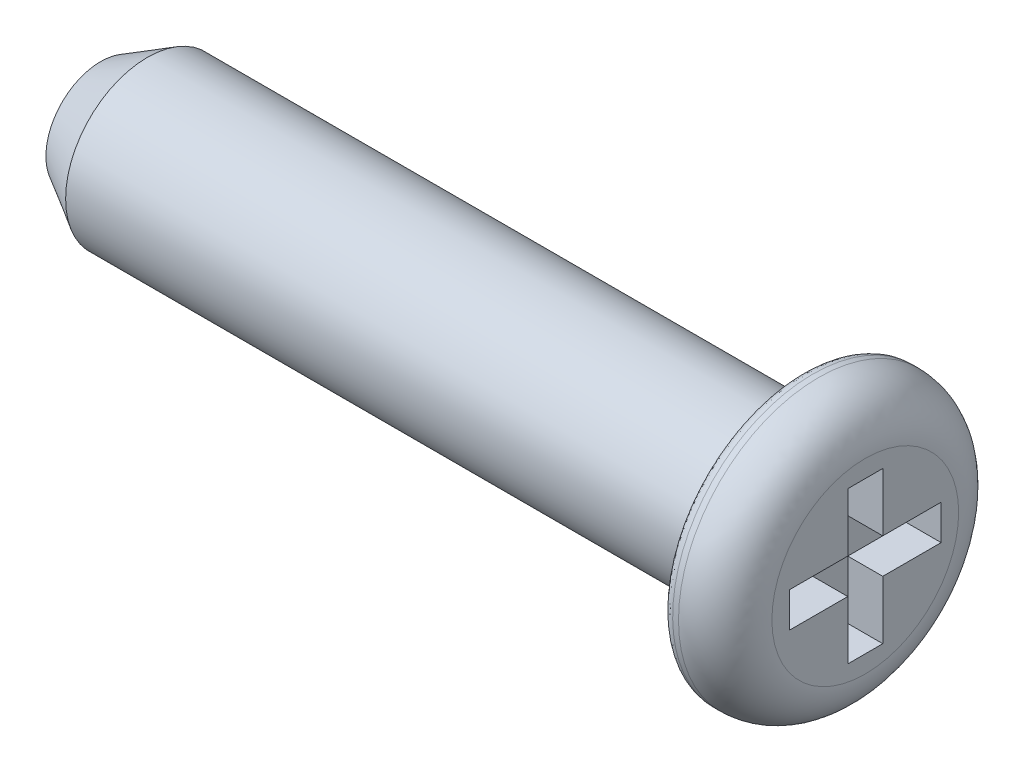
ISO-10303-21;
HEADER;
FILE_DESCRIPTION(('STEP AP214'),'2;1');
FILE_NAME('part.step','',(''),(''),'','','');
FILE_SCHEMA(('AUTOMOTIVE_DESIGN { 1 0 10303 214 1 1 1 1 }'));
ENDSEC;
DATA;
#1=APPLICATION_CONTEXT('core data for automotive mechanical design processes');
#2=APPLICATION_PROTOCOL_DEFINITION('international standard','automotive_design',2000,#1);
#3=PRODUCT_CONTEXT('',#1,'mechanical');
#4=PRODUCT('Part','Part','',(#3));
#5=PRODUCT_RELATED_PRODUCT_CATEGORY('part','',(#4));
#6=PRODUCT_DEFINITION_FORMATION('','',#4);
#7=PRODUCT_DEFINITION_CONTEXT('part definition',#1,'design');
#8=PRODUCT_DEFINITION('design','',#6,#7);
#9=PRODUCT_DEFINITION_SHAPE('','',#8);
#10=(LENGTH_UNIT() NAMED_UNIT(*) SI_UNIT(.MILLI.,.METRE.));
#11=(NAMED_UNIT(*) PLANE_ANGLE_UNIT() SI_UNIT($,.RADIAN.));
#12=(NAMED_UNIT(*) SI_UNIT($,.STERADIAN.) SOLID_ANGLE_UNIT());
#13=UNCERTAINTY_MEASURE_WITH_UNIT(LENGTH_MEASURE(1.E-05),#10,'distance_accuracy_value','');
#14=(GEOMETRIC_REPRESENTATION_CONTEXT(3) GLOBAL_UNCERTAINTY_ASSIGNED_CONTEXT((#13)) GLOBAL_UNIT_ASSIGNED_CONTEXT((#10,
#11,#12)) REPRESENTATION_CONTEXT('',''));
#15=CARTESIAN_POINT('',(0.,0.,0.));
#16=DIRECTION('',(0.,0.,1.));
#17=DIRECTION('',(1.,0.,0.));
#18=AXIS2_PLACEMENT_3D('',#15,#16,#17);
#19=CARTESIAN_POINT('',(6.75,3.124,9.876));
#20=DIRECTION('',(1.,0.,0.));
#21=DIRECTION('',(0.,0.,-1.));
#22=AXIS2_PLACEMENT_3D('',#19,#20,#21);
#23=PLANE('',#22);
#24=DIRECTION('',(0.,-1.,0.));
#25=VECTOR('',#24,1.);
#26=CARTESIAN_POINT('',(6.75,3.8,9.85));
#27=LINE('',#26,#25);
#28=CARTESIAN_POINT('',(6.75,3.95,9.85));
#29=VERTEX_POINT('',#28);
#30=CARTESIAN_POINT('',(6.75,3.65,9.85));
#31=VERTEX_POINT('',#30);
#32=EDGE_CURVE('E184',#29,#31,#27,.T.);
#33=ORIENTED_EDGE('',*,*,#32,.T.);
#34=DIRECTION('',(0.,0.,-1.));
#35=VECTOR('',#34,1.);
#36=CARTESIAN_POINT('',(6.75,3.65,9.6));
#37=LINE('',#36,#35);
#38=CARTESIAN_POINT('',(6.75,3.65,9.35));
#39=VERTEX_POINT('',#38);
#40=EDGE_CURVE('E376',#31,#39,#37,.T.);
#41=ORIENTED_EDGE('',*,*,#40,.T.);
#42=DIRECTION('',(0.,-1.,0.));
#43=VECTOR('',#42,1.);
#44=CARTESIAN_POINT('',(6.75,3.4,9.35));
#45=LINE('',#44,#43);
#46=CARTESIAN_POINT('',(6.75,3.15,9.35));
#47=VERTEX_POINT('',#46);
#48=EDGE_CURVE('E370',#39,#47,#45,.T.);
#49=ORIENTED_EDGE('',*,*,#48,.T.);
#50=DIRECTION('',(0.,0.,-1.));
#51=VECTOR('',#50,1.);
#52=CARTESIAN_POINT('',(6.75,3.15,9.2));
#53=LINE('',#52,#51);
#54=CARTESIAN_POINT('',(6.75,3.15,9.05));
#55=VERTEX_POINT('',#54);
#56=EDGE_CURVE('E363',#47,#55,#53,.T.);
#57=ORIENTED_EDGE('',*,*,#56,.T.);
#58=DIRECTION('',(0.,1.,0.));
#59=VECTOR('',#58,1.);
#60=CARTESIAN_POINT('',(6.75,3.4,9.05));
#61=LINE('',#60,#59);
#62=CARTESIAN_POINT('',(6.75,3.65,9.05));
#63=VERTEX_POINT('',#62);
#64=EDGE_CURVE('E356',#55,#63,#61,.T.);
#65=ORIENTED_EDGE('',*,*,#64,.T.);
#66=DIRECTION('',(0.,0.,-1.));
#67=VECTOR('',#66,1.);
#68=CARTESIAN_POINT('',(6.75,3.65,8.8));
#69=LINE('',#68,#67);
#70=CARTESIAN_POINT('',(6.75,3.65,8.55));
#71=VERTEX_POINT('',#70);
#72=EDGE_CURVE('E349',#63,#71,#69,.T.);
#73=ORIENTED_EDGE('',*,*,#72,.T.);
#74=DIRECTION('',(0.,1.,0.));
#75=VECTOR('',#74,1.);
#76=CARTESIAN_POINT('',(6.75,3.8,8.55));
#77=LINE('',#76,#75);
#78=CARTESIAN_POINT('',(6.75,3.95,8.55));
#79=VERTEX_POINT('',#78);
#80=EDGE_CURVE('E342',#71,#79,#77,.T.);
#81=ORIENTED_EDGE('',*,*,#80,.T.);
#82=DIRECTION('',(0.,0.,1.));
#83=VECTOR('',#82,1.);
#84=CARTESIAN_POINT('',(6.75,3.95,8.8));
#85=LINE('',#84,#83);
#86=CARTESIAN_POINT('',(6.75,3.95,9.05));
#87=VERTEX_POINT('',#86);
#88=EDGE_CURVE('E335',#79,#87,#85,.T.);
#89=ORIENTED_EDGE('',*,*,#88,.T.);
#90=DIRECTION('',(0.,1.,0.));
#91=VECTOR('',#90,1.);
#92=CARTESIAN_POINT('',(6.75,4.2,9.05));
#93=LINE('',#92,#91);
#94=CARTESIAN_POINT('',(6.75,4.45,9.05));
#95=VERTEX_POINT('',#94);
#96=EDGE_CURVE('E328',#87,#95,#93,.T.);
#97=ORIENTED_EDGE('',*,*,#96,.T.);
#98=DIRECTION('',(0.,0.,1.));
#99=VECTOR('',#98,1.);
#100=CARTESIAN_POINT('',(6.75,4.45,9.2));
#101=LINE('',#100,#99);
#102=CARTESIAN_POINT('',(6.75,4.45,9.35));
#103=VERTEX_POINT('',#102);
#104=EDGE_CURVE('E161',#95,#103,#101,.T.);
#105=ORIENTED_EDGE('',*,*,#104,.T.);
#106=DIRECTION('',(0.,-1.,0.));
#107=VECTOR('',#106,1.);
#108=CARTESIAN_POINT('',(6.75,4.2,9.35));
#109=LINE('',#108,#107);
#110=CARTESIAN_POINT('',(6.75,3.95,9.35));
#111=VERTEX_POINT('',#110);
#112=EDGE_CURVE('E158',#103,#111,#109,.T.);
#113=ORIENTED_EDGE('',*,*,#112,.T.);
#114=DIRECTION('',(0.,0.,1.));
#115=VECTOR('',#114,1.);
#116=CARTESIAN_POINT('',(6.75,3.95,9.6));
#117=LINE('',#116,#115);
#118=EDGE_CURVE('E154',#111,#29,#117,.T.);
#119=ORIENTED_EDGE('',*,*,#118,.T.);
#120=EDGE_LOOP('',(#33,#41,#49,#57,#65,#73,#81,#89,#97,#105,#113,#119));
#121=FACE_BOUND('',#120,.T.);
#122=ADVANCED_FACE('F24',(#121),#23,.T.);
#123=CARTESIAN_POINT('',(6.741146467985,4.46,9.35));
#124=DIRECTION('',(0.,0.,1.));
#125=DIRECTION('',(0.,-1.,0.));
#126=AXIS2_PLACEMENT_3D('',#123,#124,#125);
#127=PLANE('',#126);
#128=ORIENTED_EDGE('',*,*,#112,.F.);
#129=DIRECTION('',(1.,0.,0.));
#130=VECTOR('',#129,1.);
#131=CARTESIAN_POINT('',(6.9,4.45,9.35));
#132=LINE('',#131,#130);
#133=CARTESIAN_POINT('',(7.05,4.45,9.35));
#134=VERTEX_POINT('',#133);
#135=EDGE_CURVE('E314',#103,#134,#132,.T.);
#136=ORIENTED_EDGE('',*,*,#135,.T.);
#137=DIRECTION('',(0.,1.,0.));
#138=VECTOR('',#137,1.);
#139=CARTESIAN_POINT('',(7.05,3.8,9.35));
#140=LINE('',#139,#138);
#141=CARTESIAN_POINT('',(7.05,3.95,9.35));
#142=VERTEX_POINT('',#141);
#143=EDGE_CURVE('E170',#134,#142,#140,.F.);
#144=ORIENTED_EDGE('',*,*,#143,.T.);
#145=DIRECTION('',(-1.,0.,0.));
#146=VECTOR('',#145,1.);
#147=CARTESIAN_POINT('',(6.9,3.95,9.35));
#148=LINE('',#147,#146);
#149=EDGE_CURVE('E165',#142,#111,#148,.T.);
#150=ORIENTED_EDGE('',*,*,#149,.T.);
#151=EDGE_LOOP('',(#128,#136,#144,#150));
#152=FACE_BOUND('',#151,.T.);
#153=ADVANCED_FACE('F168',(#152),#127,.F.);
#154=CARTESIAN_POINT('',(6.741146467985,3.95,9.34));
#155=DIRECTION('',(0.,1.,0.));
#156=DIRECTION('',(0.,0.,1.));
#157=AXIS2_PLACEMENT_3D('',#154,#155,#156);
#158=PLANE('',#157);
#159=ORIENTED_EDGE('',*,*,#118,.F.);
#160=ORIENTED_EDGE('',*,*,#149,.F.);
#161=DIRECTION('',(0.,0.,-1.));
#162=VECTOR('',#161,1.);
#163=CARTESIAN_POINT('',(7.05,3.95,9.2));
#164=LINE('',#163,#162);
#165=CARTESIAN_POINT('',(7.05,3.95,9.85));
#166=VERTEX_POINT('',#165);
#167=EDGE_CURVE('E438',#142,#166,#164,.F.);
#168=ORIENTED_EDGE('',*,*,#167,.T.);
#169=DIRECTION('',(-1.,0.,0.));
#170=VECTOR('',#169,1.);
#171=CARTESIAN_POINT('',(6.9,3.95,9.85));
#172=LINE('',#171,#170);
#173=EDGE_CURVE('E177',#166,#29,#172,.T.);
#174=ORIENTED_EDGE('',*,*,#173,.T.);
#175=EDGE_LOOP('',(#159,#160,#168,#174));
#176=FACE_BOUND('',#175,.T.);
#177=ADVANCED_FACE('F175',(#176),#158,.F.);
#178=CARTESIAN_POINT('',(6.741146467985,3.958853532015,9.85));
#179=DIRECTION('',(0.,0.,1.));
#180=DIRECTION('',(0.,-1.,0.));
#181=AXIS2_PLACEMENT_3D('',#178,#179,#180);
#182=PLANE('',#181);
#183=ORIENTED_EDGE('',*,*,#32,.F.);
#184=ORIENTED_EDGE('',*,*,#173,.F.);
#185=DIRECTION('',(0.,1.,0.));
#186=VECTOR('',#185,1.);
#187=CARTESIAN_POINT('',(7.05,3.8,9.85));
#188=LINE('',#187,#186);
#189=CARTESIAN_POINT('',(7.05,3.65,9.85));
#190=VERTEX_POINT('',#189);
#191=EDGE_CURVE('E388',#166,#190,#188,.F.);
#192=ORIENTED_EDGE('',*,*,#191,.T.);
#193=DIRECTION('',(-1.,0.,0.));
#194=VECTOR('',#193,1.);
#195=CARTESIAN_POINT('',(6.9,3.65,9.85));
#196=LINE('',#195,#194);
#197=EDGE_CURVE('E379',#190,#31,#196,.T.);
#198=ORIENTED_EDGE('',*,*,#197,.T.);
#199=EDGE_LOOP('',(#183,#184,#192,#198));
#200=FACE_BOUND('',#199,.T.);
#201=ADVANCED_FACE('F386',(#200),#182,.F.);
#202=CARTESIAN_POINT('',(6.741146467985,3.65,9.86));
#203=DIRECTION('',(0.,-1.,0.));
#204=DIRECTION('',(0.,0.,-1.));
#205=AXIS2_PLACEMENT_3D('',#202,#203,#204);
#206=PLANE('',#205);
#207=ORIENTED_EDGE('',*,*,#40,.F.);
#208=ORIENTED_EDGE('',*,*,#197,.F.);
#209=DIRECTION('',(0.,0.,1.));
#210=VECTOR('',#209,1.);
#211=CARTESIAN_POINT('',(7.05,3.65,9.2));
#212=LINE('',#211,#210);
#213=CARTESIAN_POINT('',(7.05,3.65,9.35));
#214=VERTEX_POINT('',#213);
#215=EDGE_CURVE('E394',#190,#214,#212,.F.);
#216=ORIENTED_EDGE('',*,*,#215,.T.);
#217=DIRECTION('',(-1.,0.,0.));
#218=VECTOR('',#217,1.);
#219=CARTESIAN_POINT('',(6.9,3.65,9.35));
#220=LINE('',#219,#218);
#221=EDGE_CURVE('E373',#214,#39,#220,.T.);
#222=ORIENTED_EDGE('',*,*,#221,.T.);
#223=EDGE_LOOP('',(#207,#208,#216,#222));
#224=FACE_BOUND('',#223,.T.);
#225=ADVANCED_FACE('F391',(#224),#206,.F.);
#226=CARTESIAN_POINT('',(6.741146467985,3.66,9.35));
#227=DIRECTION('',(0.,0.,1.));
#228=DIRECTION('',(0.,-1.,0.));
#229=AXIS2_PLACEMENT_3D('',#226,#227,#228);
#230=PLANE('',#229);
#231=ORIENTED_EDGE('',*,*,#48,.F.);
#232=ORIENTED_EDGE('',*,*,#221,.F.);
#233=DIRECTION('',(0.,1.,0.));
#234=VECTOR('',#233,1.);
#235=CARTESIAN_POINT('',(7.05,3.8,9.35));
#236=LINE('',#235,#234);
#237=CARTESIAN_POINT('',(7.05,3.15,9.35));
#238=VERTEX_POINT('',#237);
#239=EDGE_CURVE('E447',#214,#238,#236,.F.);
#240=ORIENTED_EDGE('',*,*,#239,.T.);
#241=DIRECTION('',(-1.,0.,0.));
#242=VECTOR('',#241,1.);
#243=CARTESIAN_POINT('',(6.9,3.15,9.35));
#244=LINE('',#243,#242);
#245=EDGE_CURVE('E366',#238,#47,#244,.T.);
#246=ORIENTED_EDGE('',*,*,#245,.T.);
#247=EDGE_LOOP('',(#231,#232,#240,#246));
#248=FACE_BOUND('',#247,.T.);
#249=ADVANCED_FACE('F397',(#248),#230,.F.);
#250=CARTESIAN_POINT('',(6.741146467985,3.15,9.358853532015));
#251=DIRECTION('',(0.,-1.,0.));
#252=DIRECTION('',(0.,0.,-1.));
#253=AXIS2_PLACEMENT_3D('',#250,#251,#252);
#254=PLANE('',#253);
#255=ORIENTED_EDGE('',*,*,#56,.F.);
#256=ORIENTED_EDGE('',*,*,#245,.F.);
#257=DIRECTION('',(0.,0.,1.));
#258=VECTOR('',#257,1.);
#259=CARTESIAN_POINT('',(7.05,3.15,9.2));
#260=LINE('',#259,#258);
#261=CARTESIAN_POINT('',(7.05,3.15,9.05));
#262=VERTEX_POINT('',#261);
#263=EDGE_CURVE('E405',#238,#262,#260,.F.);
#264=ORIENTED_EDGE('',*,*,#263,.T.);
#265=DIRECTION('',(-1.,0.,0.));
#266=VECTOR('',#265,1.);
#267=CARTESIAN_POINT('',(6.9,3.15,9.05));
#268=LINE('',#267,#266);
#269=EDGE_CURVE('E359',#262,#55,#268,.T.);
#270=ORIENTED_EDGE('',*,*,#269,.T.);
#271=EDGE_LOOP('',(#255,#256,#264,#270));
#272=FACE_BOUND('',#271,.T.);
#273=ADVANCED_FACE('F403',(#272),#254,.F.);
#274=CARTESIAN_POINT('',(6.741146467985,3.14,9.05));
#275=DIRECTION('',(0.,0.,-1.));
#276=DIRECTION('',(0.,1.,0.));
#277=AXIS2_PLACEMENT_3D('',#274,#275,#276);
#278=PLANE('',#277);
#279=ORIENTED_EDGE('',*,*,#64,.F.);
#280=ORIENTED_EDGE('',*,*,#269,.F.);
#281=DIRECTION('',(0.,-1.,0.));
#282=VECTOR('',#281,1.);
#283=CARTESIAN_POINT('',(7.05,3.8,9.05));
#284=LINE('',#283,#282);
#285=CARTESIAN_POINT('',(7.05,3.65,9.05));
#286=VERTEX_POINT('',#285);
#287=EDGE_CURVE('E411',#262,#286,#284,.F.);
#288=ORIENTED_EDGE('',*,*,#287,.T.);
#289=DIRECTION('',(-1.,0.,0.));
#290=VECTOR('',#289,1.);
#291=CARTESIAN_POINT('',(6.9,3.65,9.05));
#292=LINE('',#291,#290);
#293=EDGE_CURVE('E352',#286,#63,#292,.T.);
#294=ORIENTED_EDGE('',*,*,#293,.T.);
#295=EDGE_LOOP('',(#279,#280,#288,#294));
#296=FACE_BOUND('',#295,.T.);
#297=ADVANCED_FACE('F408',(#296),#278,.F.);
#298=CARTESIAN_POINT('',(6.741146467985,3.65,9.06));
#299=DIRECTION('',(0.,-1.,0.));
#300=DIRECTION('',(0.,0.,-1.));
#301=AXIS2_PLACEMENT_3D('',#298,#299,#300);
#302=PLANE('',#301);
#303=ORIENTED_EDGE('',*,*,#72,.F.);
#304=ORIENTED_EDGE('',*,*,#293,.F.);
#305=DIRECTION('',(0.,0.,1.));
#306=VECTOR('',#305,1.);
#307=CARTESIAN_POINT('',(7.05,3.65,9.2));
#308=LINE('',#307,#306);
#309=CARTESIAN_POINT('',(7.05,3.65,8.55));
#310=VERTEX_POINT('',#309);
#311=EDGE_CURVE('E454',#286,#310,#308,.F.);
#312=ORIENTED_EDGE('',*,*,#311,.T.);
#313=DIRECTION('',(-1.,0.,0.));
#314=VECTOR('',#313,1.);
#315=CARTESIAN_POINT('',(6.9,3.65,8.55));
#316=LINE('',#315,#314);
#317=EDGE_CURVE('E345',#310,#71,#316,.T.);
#318=ORIENTED_EDGE('',*,*,#317,.T.);
#319=EDGE_LOOP('',(#303,#304,#312,#318));
#320=FACE_BOUND('',#319,.T.);
#321=ADVANCED_FACE('F414',(#320),#302,.F.);
#322=CARTESIAN_POINT('',(6.741146467985,3.641146467985,8.55));
#323=DIRECTION('',(0.,0.,-1.));
#324=DIRECTION('',(0.,1.,0.));
#325=AXIS2_PLACEMENT_3D('',#322,#323,#324);
#326=PLANE('',#325);
#327=ORIENTED_EDGE('',*,*,#80,.F.);
#328=ORIENTED_EDGE('',*,*,#317,.F.);
#329=DIRECTION('',(0.,-1.,0.));
#330=VECTOR('',#329,1.);
#331=CARTESIAN_POINT('',(7.05,3.8,8.55));
#332=LINE('',#331,#330);
#333=CARTESIAN_POINT('',(7.05,3.95,8.55));
#334=VERTEX_POINT('',#333);
#335=EDGE_CURVE('E422',#310,#334,#332,.F.);
#336=ORIENTED_EDGE('',*,*,#335,.T.);
#337=DIRECTION('',(-1.,0.,0.));
#338=VECTOR('',#337,1.);
#339=CARTESIAN_POINT('',(6.9,3.95,8.55));
#340=LINE('',#339,#338);
#341=EDGE_CURVE('E338',#334,#79,#340,.T.);
#342=ORIENTED_EDGE('',*,*,#341,.T.);
#343=EDGE_LOOP('',(#327,#328,#336,#342));
#344=FACE_BOUND('',#343,.T.);
#345=ADVANCED_FACE('F420',(#344),#326,.F.);
#346=CARTESIAN_POINT('',(6.741146467985,3.95,8.54));
#347=DIRECTION('',(0.,1.,0.));
#348=DIRECTION('',(0.,0.,1.));
#349=AXIS2_PLACEMENT_3D('',#346,#347,#348);
#350=PLANE('',#349);
#351=ORIENTED_EDGE('',*,*,#88,.F.);
#352=ORIENTED_EDGE('',*,*,#341,.F.);
#353=DIRECTION('',(0.,0.,-1.));
#354=VECTOR('',#353,1.);
#355=CARTESIAN_POINT('',(7.05,3.95,9.2));
#356=LINE('',#355,#354);
#357=CARTESIAN_POINT('',(7.05,3.95,9.05));
#358=VERTEX_POINT('',#357);
#359=EDGE_CURVE('E428',#334,#358,#356,.F.);
#360=ORIENTED_EDGE('',*,*,#359,.T.);
#361=DIRECTION('',(-1.,0.,0.));
#362=VECTOR('',#361,1.);
#363=CARTESIAN_POINT('',(6.9,3.95,9.05));
#364=LINE('',#363,#362);
#365=EDGE_CURVE('E331',#358,#87,#364,.T.);
#366=ORIENTED_EDGE('',*,*,#365,.T.);
#367=EDGE_LOOP('',(#351,#352,#360,#366));
#368=FACE_BOUND('',#367,.T.);
#369=ADVANCED_FACE('F425',(#368),#350,.F.);
#370=CARTESIAN_POINT('',(6.741146467985,3.94,9.05));
#371=DIRECTION('',(0.,0.,-1.));
#372=DIRECTION('',(0.,1.,0.));
#373=AXIS2_PLACEMENT_3D('',#370,#371,#372);
#374=PLANE('',#373);
#375=ORIENTED_EDGE('',*,*,#96,.F.);
#376=ORIENTED_EDGE('',*,*,#365,.F.);
#377=DIRECTION('',(0.,-1.,0.));
#378=VECTOR('',#377,1.);
#379=CARTESIAN_POINT('',(7.05,3.8,9.05));
#380=LINE('',#379,#378);
#381=CARTESIAN_POINT('',(7.05,4.45,9.05));
#382=VERTEX_POINT('',#381);
#383=EDGE_CURVE('E433',#358,#382,#380,.F.);
#384=ORIENTED_EDGE('',*,*,#383,.T.);
#385=DIRECTION('',(-1.,0.,0.));
#386=VECTOR('',#385,1.);
#387=CARTESIAN_POINT('',(6.9,4.45,9.05));
#388=LINE('',#387,#386);
#389=EDGE_CURVE('E324',#382,#95,#388,.T.);
#390=ORIENTED_EDGE('',*,*,#389,.T.);
#391=EDGE_LOOP('',(#375,#376,#384,#390));
#392=FACE_BOUND('',#391,.T.);
#393=ADVANCED_FACE('F431',(#392),#374,.F.);
#394=CARTESIAN_POINT('',(6.741146467985,4.45,9.041146467985));
#395=DIRECTION('',(0.,1.,0.));
#396=DIRECTION('',(0.,0.,1.));
#397=AXIS2_PLACEMENT_3D('',#394,#395,#396);
#398=PLANE('',#397);
#399=ORIENTED_EDGE('',*,*,#104,.F.);
#400=ORIENTED_EDGE('',*,*,#389,.F.);
#401=DIRECTION('',(0.,0.,-1.));
#402=VECTOR('',#401,1.);
#403=CARTESIAN_POINT('',(7.05,4.45,9.2));
#404=LINE('',#403,#402);
#405=EDGE_CURVE('E297',#382,#134,#404,.F.);
#406=ORIENTED_EDGE('',*,*,#405,.T.);
#407=ORIENTED_EDGE('',*,*,#135,.F.);
#408=EDGE_LOOP('',(#399,#400,#406,#407));
#409=FACE_BOUND('',#408,.T.);
#410=ADVANCED_FACE('F208',(#409),#398,.F.);
#411=CARTESIAN_POINT('',(7.05,2.967166420633,10.032));
#412=DIRECTION('',(1.,0.,0.));
#413=DIRECTION('',(0.,0.,-1.));
#414=AXIS2_PLACEMENT_3D('',#411,#412,#413);
#415=PLANE('',#414);
#416=ORIENTED_EDGE('',*,*,#383,.F.);
#417=ORIENTED_EDGE('',*,*,#359,.F.);
#418=ORIENTED_EDGE('',*,*,#335,.F.);
#419=ORIENTED_EDGE('',*,*,#311,.F.);
#420=ORIENTED_EDGE('',*,*,#287,.F.);
#421=ORIENTED_EDGE('',*,*,#263,.F.);
#422=ORIENTED_EDGE('',*,*,#239,.F.);
#423=ORIENTED_EDGE('',*,*,#215,.F.);
#424=ORIENTED_EDGE('',*,*,#191,.F.);
#425=ORIENTED_EDGE('',*,*,#167,.F.);
#426=ORIENTED_EDGE('',*,*,#143,.F.);
#427=ORIENTED_EDGE('',*,*,#405,.F.);
#428=EDGE_LOOP('',(#416,#417,#418,#419,#420,#421,#422,#423,#424,#425,#426,#427));
#429=FACE_BOUND('',#428,.T.);
#430=CARTESIAN_POINT('',(7.05000000000001,3.8,9.2));
#431=DIRECTION('',(-1.,0.,0.));
#432=DIRECTION('',(0.,0.,-1.));
#433=AXIS2_PLACEMENT_3D('',#430,#431,#432);
#434=CIRCLE('',#433,0.799999991004705);
#435=CARTESIAN_POINT('',(7.05000000000001,3.79999999999999,9.9999999919042));
#436=VERTEX_POINT('',#435);
#437=CARTESIAN_POINT('',(7.05000000000001,3.80000000000002,8.4000000080958));
#438=VERTEX_POINT('',#437);
#439=EDGE_CURVE('E191',#436,#438,#434,.F.);
#440=ORIENTED_EDGE('',*,*,#439,.T.);
#441=CARTESIAN_POINT('',(7.05000000000001,3.8,9.2));
#442=DIRECTION('',(-1.,0.,0.));
#443=DIRECTION('',(0.,0.,1.));
#444=AXIS2_PLACEMENT_3D('',#441,#442,#443);
#445=CIRCLE('',#444,0.799999991004699);
#446=EDGE_CURVE('E292',#438,#436,#445,.F.);
#447=ORIENTED_EDGE('',*,*,#446,.T.);
#448=EDGE_LOOP('',(#440,#447));
#449=FACE_BOUND('',#448,.T.);
#450=ADVANCED_FACE('F198',(#429,#449),#415,.T.);
#451=CARTESIAN_POINT('',(6.63743568920142,3.78865757276304,8.00025099053532));
#452=CARTESIAN_POINT('',(6.88347384142366,3.78858447708785,7.99251927120719));
#453=CARTESIAN_POINT('',(7.05753489804068,3.79022997827261,8.1665727057349));
#454=CARTESIAN_POINT('',(7.04980261265878,3.79255591897725,8.41259985655019));
#455=(BOUNDED_CURVE() B_SPLINE_CURVE(3,(#451,#452,#453,#454),.UNSPECIFIED.,.F.,
.F.) B_SPLINE_CURVE_WITH_KNOTS((4,4),(0.,1.),
.UNSPECIFIED.) CURVE() GEOMETRIC_REPRESENTATION_ITEM() RATIONAL_B_SPLINE_CURVE((1.,
0.789697844101268,0.789697844101268,1.)) REPRESENTATION_ITEM(''));
#456=CARTESIAN_POINT('',(6.65,3.8,9.2));
#457=DIRECTION('',(1.,0.,0.));
#458=AXIS1_PLACEMENT('',#456,#457);
#459=SURFACE_OF_REVOLUTION('',#455,#458);
#460=CARTESIAN_POINT('',(6.65,3.8,9.2));
#461=DIRECTION('',(1.,0.,0.));
#462=DIRECTION('',(0.,0.,-1.));
#463=AXIS2_PLACEMENT_3D('',#460,#461,#462);
#464=CIRCLE('',#463,1.2);
#465=CARTESIAN_POINT('',(6.65,3.8,8.));
#466=VERTEX_POINT('',#465);
#467=EDGE_CURVE('E288',#466,#466,#464,.T.);
#468=ORIENTED_EDGE('',*,*,#467,.T.);
#469=EDGE_LOOP('',(#468));
#470=FACE_BOUND('',#469,.T.);
#471=ORIENTED_EDGE('',*,*,#439,.F.);
#472=ORIENTED_EDGE('',*,*,#446,.F.);
#473=EDGE_LOOP('',(#471,#472));
#474=FACE_BOUND('',#473,.T.);
#475=ADVANCED_FACE('F207',(#470,#474),#459,.T.);
#476=CARTESIAN_POINT('',(6.6,3.8,9.2));
#477=DIRECTION('',(1.,0.,0.));
#478=DIRECTION('',(0.,1.,0.));
#479=AXIS2_PLACEMENT_3D('',#476,#477,#478);
#480=CYLINDRICAL_SURFACE('',#479,1.2);
#481=CARTESIAN_POINT('',(6.6,3.8,9.2));
#482=DIRECTION('',(1.,0.,0.));
#483=DIRECTION('',(0.,-0.0134291293990943,0.999909825176042));
#484=AXIS2_PLACEMENT_3D('',#481,#482,#483);
#485=CIRCLE('',#484,1.19999999999634);
#486=CARTESIAN_POINT('',(6.6,3.78388504472114,10.3998917902076));
#487=VERTEX_POINT('',#486);
#488=EDGE_CURVE('E284',#487,#487,#485,.T.);
#489=ORIENTED_EDGE('',*,*,#488,.T.);
#490=EDGE_LOOP('',(#489));
#491=FACE_BOUND('',#490,.T.);
#492=ORIENTED_EDGE('',*,*,#467,.F.);
#493=EDGE_LOOP('',(#492));
#494=FACE_BOUND('',#493,.T.);
#495=ADVANCED_FACE('F260',(#491,#494),#480,.T.);
#496=CARTESIAN_POINT('',(6.50039170687413,3.78534670332098,10.2910592105481));
#497=CARTESIAN_POINT('',(6.49445300850722,3.78444831367662,10.3579517547749));
#498=CARTESIAN_POINT('',(6.54194336804711,3.78381055677614,10.4054380341856));
#499=CARTESIAN_POINT('',(6.60884197014127,3.78389030449756,10.3995001563226));
#500=(BOUNDED_CURVE() B_SPLINE_CURVE(3,(#496,#497,#498,#499),.UNSPECIFIED.,.F.,
.F.) B_SPLINE_CURVE_WITH_KNOTS((4,4),(0.,1.),
.UNSPECIFIED.) CURVE() GEOMETRIC_REPRESENTATION_ITEM() RATIONAL_B_SPLINE_CURVE((1.,
0.761208971798791,0.761208971798791,1.)) REPRESENTATION_ITEM(''));
#501=CARTESIAN_POINT('',(6.6,3.8,9.2));
#502=DIRECTION('',(1.,0.,0.));
#503=AXIS1_PLACEMENT('',#501,#502);
#504=SURFACE_OF_REVOLUTION('',#500,#503);
#505=ORIENTED_EDGE('',*,*,#488,.F.);
#506=EDGE_LOOP('',(#505));
#507=FACE_BOUND('',#506,.T.);
#508=CARTESIAN_POINT('',(6.5,3.8,9.2));
#509=DIRECTION('',(1.,0.,0.));
#510=DIRECTION('',(0.,0.,1.));
#511=AXIS2_PLACEMENT_3D('',#508,#509,#510);
#512=CIRCLE('',#511,1.09999998207468);
#513=CARTESIAN_POINT('',(6.5,3.79999999999998,10.2999999749036));
#514=VERTEX_POINT('',#513);
#515=CARTESIAN_POINT('',(6.5,3.80000000000001,8.10000002509639));
#516=VERTEX_POINT('',#515);
#517=EDGE_CURVE('E48',#514,#516,#512,.T.);
#518=ORIENTED_EDGE('',*,*,#517,.T.);
#519=CARTESIAN_POINT('',(6.5,3.8,9.2));
#520=DIRECTION('',(1.,0.,0.));
#521=DIRECTION('',(0.,0.,-1.));
#522=AXIS2_PLACEMENT_3D('',#519,#520,#521);
#523=CIRCLE('',#522,1.09999998207268);
#524=EDGE_CURVE('E233',#516,#514,#523,.T.);
#525=ORIENTED_EDGE('',*,*,#524,.T.);
#526=EDGE_LOOP('',(#518,#525));
#527=FACE_BOUND('',#526,.T.);
#528=ADVANCED_FACE('F249',(#507,#527),#504,.T.);
#529=CARTESIAN_POINT('',(6.5,2.655999997477,10.344));
#530=DIRECTION('',(1.,0.,0.));
#531=DIRECTION('',(0.,0.,-1.));
#532=AXIS2_PLACEMENT_3D('',#529,#530,#531);
#533=PLANE('',#532);
#534=CARTESIAN_POINT('',(6.5,3.8,9.2));
#535=DIRECTION('',(-1.,0.,0.));
#536=DIRECTION('',(0.,0.,1.));
#537=AXIS2_PLACEMENT_3D('',#534,#535,#536);
#538=CIRCLE('',#537,0.7);
#539=CARTESIAN_POINT('',(6.5,3.8,9.9));
#540=VERTEX_POINT('',#539);
#541=EDGE_CURVE('E242',#540,#540,#538,.F.);
#542=ORIENTED_EDGE('',*,*,#541,.T.);
#543=EDGE_LOOP('',(#542));
#544=FACE_BOUND('',#543,.T.);
#545=ORIENTED_EDGE('',*,*,#517,.F.);
#546=ORIENTED_EDGE('',*,*,#524,.F.);
#547=EDGE_LOOP('',(#545,#546));
#548=FACE_BOUND('',#547,.T.);
#549=ADVANCED_FACE('F211',(#544,#548),#533,.F.);
#550=CARTESIAN_POINT('',(6.5,3.8,9.2));
#551=DIRECTION('',(-1.,0.,0.));
#552=DIRECTION('',(0.,0.,1.));
#553=AXIS2_PLACEMENT_3D('',#550,#551,#552);
#554=CYLINDRICAL_SURFACE('',#553,0.7);
#555=CARTESIAN_POINT('',(0.899999999999792,3.8,9.2));
#556=DIRECTION('',(-1.,0.,0.));
#557=DIRECTION('',(0.,-1.,0.));
#558=AXIS2_PLACEMENT_3D('',#555,#556,#557);
#559=CIRCLE('',#558,0.70000000000036);
#560=CARTESIAN_POINT('',(0.899999999999792,3.09999999999964,9.2));
#561=VERTEX_POINT('',#560);
#562=EDGE_CURVE('E37',#561,#561,#559,.F.);
#563=ORIENTED_EDGE('',*,*,#562,.T.);
#564=EDGE_LOOP('',(#563));
#565=FACE_BOUND('',#564,.T.);
#566=ORIENTED_EDGE('',*,*,#541,.F.);
#567=EDGE_LOOP('',(#566));
#568=FACE_BOUND('',#567,.T.);
#569=ADVANCED_FACE('F262',(#565,#568),#554,.T.);
#570=CARTESIAN_POINT('',(0.899999999999792,3.8,9.2));
#571=DIRECTION('',(1.,0.,0.));
#572=DIRECTION('',(0.,0.,-1.));
#573=AXIS2_PLACEMENT_3D('',#570,#571,#572);
#574=CONICAL_SURFACE('',#573,0.70000000000036,0.523598775598506);
#575=ORIENTED_EDGE('',*,*,#562,.F.);
#576=EDGE_LOOP('',(#575));
#577=FACE_BOUND('',#576,.T.);
#578=CARTESIAN_POINT('',(0.499999999999818,3.8,9.2));
#579=DIRECTION('',(1.,0.,0.));
#580=DIRECTION('',(0.,0.,-1.));
#581=AXIS2_PLACEMENT_3D('',#578,#579,#580);
#582=CIRCLE('',#581,0.469059892324415);
#583=CARTESIAN_POINT('',(0.499999999999818,3.8,8.73094010767558));
#584=VERTEX_POINT('',#583);
#585=EDGE_CURVE('E13',#584,#584,#582,.T.);
#586=ORIENTED_EDGE('',*,*,#585,.T.);
#587=EDGE_LOOP('',(#586));
#588=FACE_BOUND('',#587,.T.);
#589=ADVANCED_FACE('F474',(#577,#588),#574,.T.);
#590=CARTESIAN_POINT('',(0.5,4.287822288017,8.712177711983));
#591=DIRECTION('',(-1.,0.,0.));
#592=DIRECTION('',(0.,-1.,0.));
#593=AXIS2_PLACEMENT_3D('',#590,#591,#592);
#594=PLANE('',#593);
#595=ORIENTED_EDGE('',*,*,#585,.F.);
#596=EDGE_LOOP('',(#595));
#597=FACE_BOUND('',#596,.T.);
#598=ADVANCED_FACE('F26',(#597),#594,.T.);
#599=CLOSED_SHELL('',(#122,#153,#177,#201,#225,#249,#273,#297,#321,#345,#369,#393,#410,#450,
#475,#495,#528,#549,#569,#589,#598));
#600=MANIFOLD_SOLID_BREP('B1',#599);
#601=ADVANCED_BREP_SHAPE_REPRESENTATION('',(#18,#600),#14);
#602=SHAPE_DEFINITION_REPRESENTATION(#9,#601);
ENDSEC;
END-ISO-10303-21;
